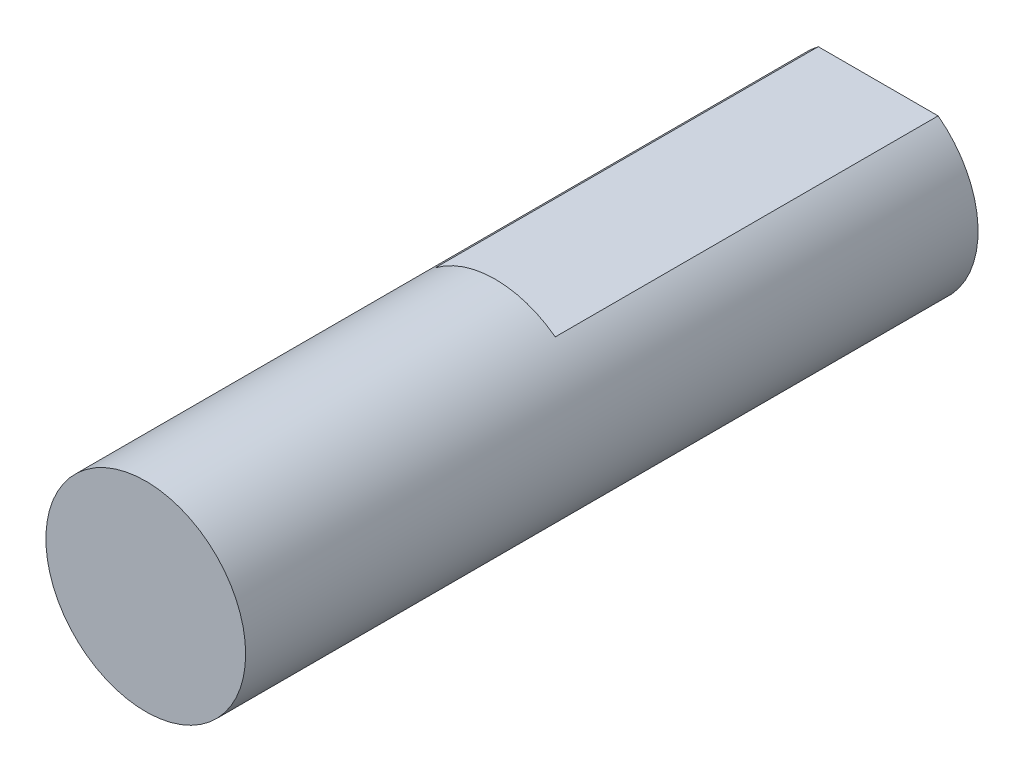
ISO-10303-21;
HEADER;
FILE_DESCRIPTION(('STEP AP214'),'2;1');
FILE_NAME('part.step','',(''),(''),'','','');
FILE_SCHEMA(('AUTOMOTIVE_DESIGN { 1 0 10303 214 1 1 1 1 }'));
ENDSEC;
DATA;
#1=APPLICATION_CONTEXT('core data for automotive mechanical design processes');
#2=APPLICATION_PROTOCOL_DEFINITION('international standard','automotive_design',2000,#1);
#3=PRODUCT_CONTEXT('',#1,'mechanical');
#4=PRODUCT('Part','Part','',(#3));
#5=PRODUCT_RELATED_PRODUCT_CATEGORY('part','',(#4));
#6=PRODUCT_DEFINITION_FORMATION('','',#4);
#7=PRODUCT_DEFINITION_CONTEXT('part definition',#1,'design');
#8=PRODUCT_DEFINITION('design','',#6,#7);
#9=PRODUCT_DEFINITION_SHAPE('','',#8);
#10=(LENGTH_UNIT() NAMED_UNIT(*) SI_UNIT(.MILLI.,.METRE.));
#11=(NAMED_UNIT(*) PLANE_ANGLE_UNIT() SI_UNIT($,.RADIAN.));
#12=(NAMED_UNIT(*) SI_UNIT($,.STERADIAN.) SOLID_ANGLE_UNIT());
#13=UNCERTAINTY_MEASURE_WITH_UNIT(LENGTH_MEASURE(1.E-05),#10,'distance_accuracy_value','');
#14=(GEOMETRIC_REPRESENTATION_CONTEXT(3) GLOBAL_UNCERTAINTY_ASSIGNED_CONTEXT((#13)) GLOBAL_UNIT_ASSIGNED_CONTEXT((#10,
#11,#12)) REPRESENTATION_CONTEXT('',''));
#15=CARTESIAN_POINT('',(0.,0.,0.));
#16=DIRECTION('',(0.,0.,1.));
#17=DIRECTION('',(1.,0.,0.));
#18=AXIS2_PLACEMENT_3D('',#15,#16,#17);
#19=CARTESIAN_POINT('',(0.,0.,22.));
#20=DIRECTION('',(0.,0.,-1.));
#21=DIRECTION('',(-1.,0.,0.));
#22=AXIS2_PLACEMENT_3D('',#19,#20,#21);
#23=CYLINDRICAL_SURFACE('',#22,3.);
#24=CARTESIAN_POINT('',(0.,0.,22.));
#25=DIRECTION('',(0.,0.,1.));
#26=DIRECTION('',(1.,0.,0.));
#27=AXIS2_PLACEMENT_3D('',#24,#25,#26);
#28=CIRCLE('',#27,3.);
#29=CARTESIAN_POINT('',(3.,0.,22.));
#30=VERTEX_POINT('',#29);
#31=EDGE_CURVE('E11',#30,#30,#28,.T.);
#32=ORIENTED_EDGE('',*,*,#31,.F.);
#33=EDGE_LOOP('',(#32));
#34=FACE_BOUND('',#33,.T.);
#35=DIRECTION('',(0.,0.,-1.));
#36=VECTOR('',#35,1.);
#37=CARTESIAN_POINT('',(1.8,2.4,11.5));
#38=LINE('',#37,#36);
#39=CARTESIAN_POINT('',(1.8,2.4,11.5));
#40=VERTEX_POINT('',#39);
#41=CARTESIAN_POINT('',(1.8,2.4,0.));
#42=VERTEX_POINT('',#41);
#43=EDGE_CURVE('E47',#40,#42,#38,.T.);
#44=ORIENTED_EDGE('',*,*,#43,.F.);
#45=CARTESIAN_POINT('',(0.,0.,11.5));
#46=DIRECTION('',(0.,0.,1.));
#47=DIRECTION('',(1.,0.,0.));
#48=AXIS2_PLACEMENT_3D('',#45,#46,#47);
#49=CIRCLE('',#48,3.);
#50=CARTESIAN_POINT('',(-1.8,2.4,11.5));
#51=VERTEX_POINT('',#50);
#52=EDGE_CURVE('E67',#40,#51,#49,.T.);
#53=ORIENTED_EDGE('',*,*,#52,.T.);
#54=DIRECTION('',(0.,0.,-1.));
#55=VECTOR('',#54,1.);
#56=CARTESIAN_POINT('',(-1.8,2.4,11.5));
#57=LINE('',#56,#55);
#58=CARTESIAN_POINT('',(-1.8,2.4,0.));
#59=VERTEX_POINT('',#58);
#60=EDGE_CURVE('E53',#51,#59,#57,.T.);
#61=ORIENTED_EDGE('',*,*,#60,.T.);
#62=CARTESIAN_POINT('',(0.,0.,0.));
#63=DIRECTION('',(0.,0.,1.));
#64=DIRECTION('',(1.,0.,0.));
#65=AXIS2_PLACEMENT_3D('',#62,#63,#64);
#66=CIRCLE('',#65,3.);
#67=EDGE_CURVE('E36',#59,#42,#66,.T.);
#68=ORIENTED_EDGE('',*,*,#67,.T.);
#69=EDGE_LOOP('',(#44,#53,#61,#68));
#70=FACE_BOUND('',#69,.T.);
#71=ADVANCED_FACE('F33',(#34,#70),#23,.T.);
#72=CARTESIAN_POINT('',(0.,0.,0.));
#73=DIRECTION('',(0.,0.,1.));
#74=DIRECTION('',(1.,0.,0.));
#75=AXIS2_PLACEMENT_3D('',#72,#73,#74);
#76=PLANE('',#75);
#77=DIRECTION('',(1.,0.,0.));
#78=VECTOR('',#77,1.);
#79=CARTESIAN_POINT('',(0.,2.4,0.));
#80=LINE('',#79,#78);
#81=EDGE_CURVE('E58',#59,#42,#80,.T.);
#82=ORIENTED_EDGE('',*,*,#81,.T.);
#83=ORIENTED_EDGE('',*,*,#67,.F.);
#84=EDGE_LOOP('',(#82,#83));
#85=FACE_BOUND('',#84,.T.);
#86=ADVANCED_FACE('F69',(#85),#76,.F.);
#87=CARTESIAN_POINT('',(0.,0.,22.));
#88=DIRECTION('',(0.,0.,1.));
#89=DIRECTION('',(1.,0.,0.));
#90=AXIS2_PLACEMENT_3D('',#87,#88,#89);
#91=PLANE('',#90);
#92=ORIENTED_EDGE('',*,*,#31,.T.);
#93=EDGE_LOOP('',(#92));
#94=FACE_BOUND('',#93,.T.);
#95=ADVANCED_FACE('F80',(#94),#91,.T.);
#96=CARTESIAN_POINT('',(0.,2.4,11.5));
#97=DIRECTION('',(0.,1.,0.));
#98=DIRECTION('',(0.,0.,1.));
#99=AXIS2_PLACEMENT_3D('',#96,#97,#98);
#100=PLANE('',#99);
#101=ORIENTED_EDGE('',*,*,#81,.F.);
#102=ORIENTED_EDGE('',*,*,#60,.F.);
#103=DIRECTION('',(1.,0.,0.));
#104=VECTOR('',#103,1.);
#105=CARTESIAN_POINT('',(0.,2.4,11.5));
#106=LINE('',#105,#104);
#107=EDGE_CURVE('E63',#51,#40,#106,.T.);
#108=ORIENTED_EDGE('',*,*,#107,.T.);
#109=ORIENTED_EDGE('',*,*,#43,.T.);
#110=EDGE_LOOP('',(#101,#102,#108,#109));
#111=FACE_BOUND('',#110,.T.);
#112=ADVANCED_FACE('F59',(#111),#100,.T.);
#113=CARTESIAN_POINT('',(0.,0.,11.5));
#114=DIRECTION('',(0.,0.,1.));
#115=DIRECTION('',(1.,0.,0.));
#116=AXIS2_PLACEMENT_3D('',#113,#114,#115);
#117=PLANE('',#116);
#118=ORIENTED_EDGE('',*,*,#107,.F.);
#119=ORIENTED_EDGE('',*,*,#52,.F.);
#120=EDGE_LOOP('',(#118,#119));
#121=FACE_BOUND('',#120,.T.);
#122=ADVANCED_FACE('F74',(#121),#117,.F.);
#123=CLOSED_SHELL('',(#71,#86,#95,#112,#122));
#124=MANIFOLD_SOLID_BREP('B2',#123);
#125=ADVANCED_BREP_SHAPE_REPRESENTATION('',(#18,#124),#14);
#126=SHAPE_DEFINITION_REPRESENTATION(#9,#125);
ENDSEC;
END-ISO-10303-21;
